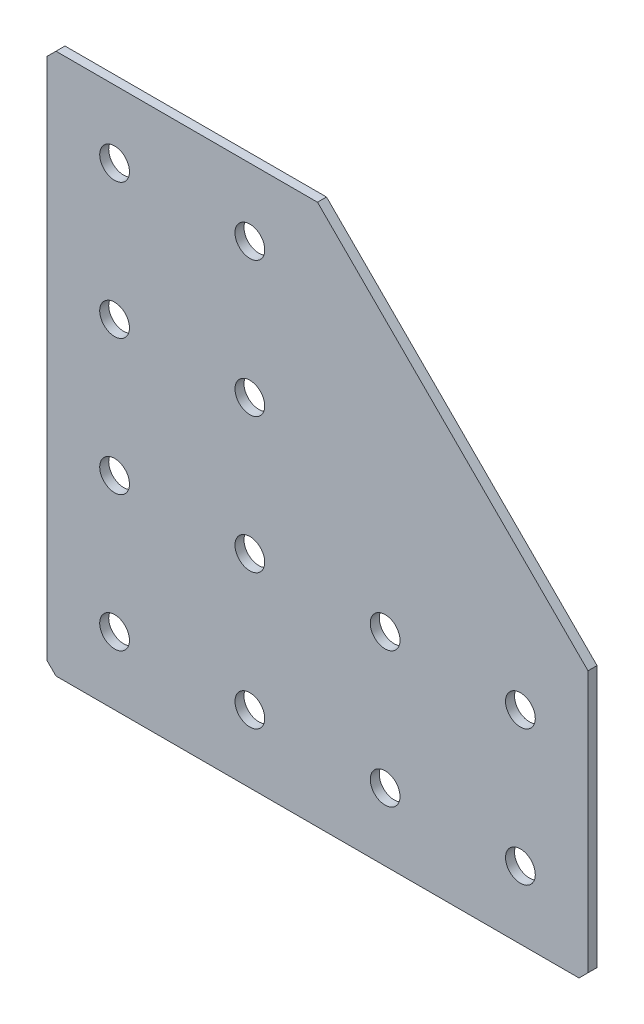
ISO-10303-21;
HEADER;
FILE_DESCRIPTION(('STEP AP214'),'2;1');
FILE_NAME('part.step','',(''),(''),'','','');
FILE_SCHEMA(('AUTOMOTIVE_DESIGN { 1 0 10303 214 1 1 1 1 }'));
ENDSEC;
DATA;
#1=APPLICATION_CONTEXT('core data for automotive mechanical design processes');
#2=APPLICATION_PROTOCOL_DEFINITION('international standard','automotive_design',2000,#1);
#3=PRODUCT_CONTEXT('',#1,'mechanical');
#4=PRODUCT('Part','Part','',(#3));
#5=PRODUCT_RELATED_PRODUCT_CATEGORY('part','',(#4));
#6=PRODUCT_DEFINITION_FORMATION('','',#4);
#7=PRODUCT_DEFINITION_CONTEXT('part definition',#1,'design');
#8=PRODUCT_DEFINITION('design','',#6,#7);
#9=PRODUCT_DEFINITION_SHAPE('','',#8);
#10=(LENGTH_UNIT() NAMED_UNIT(*) SI_UNIT(.MILLI.,.METRE.));
#11=(NAMED_UNIT(*) PLANE_ANGLE_UNIT() SI_UNIT($,.RADIAN.));
#12=(NAMED_UNIT(*) SI_UNIT($,.STERADIAN.) SOLID_ANGLE_UNIT());
#13=UNCERTAINTY_MEASURE_WITH_UNIT(LENGTH_MEASURE(1.E-05),#10,'distance_accuracy_value','');
#14=(GEOMETRIC_REPRESENTATION_CONTEXT(3) GLOBAL_UNCERTAINTY_ASSIGNED_CONTEXT((#13)) GLOBAL_UNIT_ASSIGNED_CONTEXT((#10,
#11,#12)) REPRESENTATION_CONTEXT('',''));
#15=CARTESIAN_POINT('',(0.,0.,0.));
#16=DIRECTION('',(0.,0.,1.));
#17=DIRECTION('',(1.,0.,0.));
#18=AXIS2_PLACEMENT_3D('',#15,#16,#17);
#19=CARTESIAN_POINT('',(0.,0.,0.));
#20=DIRECTION('',(0.,0.,1.));
#21=DIRECTION('',(1.,0.,0.));
#22=AXIS2_PLACEMENT_3D('',#19,#20,#21);
#23=PLANE('',#22);
#24=CARTESIAN_POINT('',(15.,-105.,0.));
#25=DIRECTION('',(0.,0.,-1.));
#26=DIRECTION('',(0.,1.,0.));
#27=AXIS2_PLACEMENT_3D('',#24,#25,#26);
#28=CIRCLE('',#27,3.3);
#29=CARTESIAN_POINT('',(15.,-101.7,0.));
#30=VERTEX_POINT('',#29);
#31=EDGE_CURVE('E239',#30,#30,#28,.T.);
#32=ORIENTED_EDGE('',*,*,#31,.T.);
#33=EDGE_LOOP('',(#32));
#34=FACE_BOUND('',#33,.T.);
#35=CARTESIAN_POINT('',(15.,-75.,0.));
#36=DIRECTION('',(0.,0.,-1.));
#37=DIRECTION('',(0.,1.,0.));
#38=AXIS2_PLACEMENT_3D('',#35,#36,#37);
#39=CIRCLE('',#38,3.3);
#40=CARTESIAN_POINT('',(15.,-71.7,0.));
#41=VERTEX_POINT('',#40);
#42=EDGE_CURVE('E233',#41,#41,#39,.T.);
#43=ORIENTED_EDGE('',*,*,#42,.T.);
#44=EDGE_LOOP('',(#43));
#45=FACE_BOUND('',#44,.T.);
#46=CARTESIAN_POINT('',(15.,-45.,0.));
#47=DIRECTION('',(0.,0.,-1.));
#48=DIRECTION('',(0.,1.,0.));
#49=AXIS2_PLACEMENT_3D('',#46,#47,#48);
#50=CIRCLE('',#49,3.3);
#51=CARTESIAN_POINT('',(15.,-41.7,0.));
#52=VERTEX_POINT('',#51);
#53=EDGE_CURVE('E227',#52,#52,#50,.T.);
#54=ORIENTED_EDGE('',*,*,#53,.T.);
#55=EDGE_LOOP('',(#54));
#56=FACE_BOUND('',#55,.T.);
#57=CARTESIAN_POINT('',(15.,-15.,0.));
#58=DIRECTION('',(0.,0.,-1.));
#59=DIRECTION('',(0.,1.,0.));
#60=AXIS2_PLACEMENT_3D('',#57,#58,#59);
#61=CIRCLE('',#60,3.3);
#62=CARTESIAN_POINT('',(15.,-11.7,0.));
#63=VERTEX_POINT('',#62);
#64=EDGE_CURVE('E221',#63,#63,#61,.T.);
#65=ORIENTED_EDGE('',*,*,#64,.T.);
#66=EDGE_LOOP('',(#65));
#67=FACE_BOUND('',#66,.T.);
#68=CARTESIAN_POINT('',(45.,-105.,0.));
#69=DIRECTION('',(0.,0.,-1.));
#70=DIRECTION('',(0.,1.,0.));
#71=AXIS2_PLACEMENT_3D('',#68,#69,#70);
#72=CIRCLE('',#71,3.3);
#73=CARTESIAN_POINT('',(45.,-101.7,0.));
#74=VERTEX_POINT('',#73);
#75=EDGE_CURVE('E215',#74,#74,#72,.T.);
#76=ORIENTED_EDGE('',*,*,#75,.T.);
#77=EDGE_LOOP('',(#76));
#78=FACE_BOUND('',#77,.T.);
#79=CARTESIAN_POINT('',(45.,-75.,0.));
#80=DIRECTION('',(0.,0.,-1.));
#81=DIRECTION('',(0.,1.,0.));
#82=AXIS2_PLACEMENT_3D('',#79,#80,#81);
#83=CIRCLE('',#82,3.3);
#84=CARTESIAN_POINT('',(45.,-71.7,0.));
#85=VERTEX_POINT('',#84);
#86=EDGE_CURVE('E209',#85,#85,#83,.T.);
#87=ORIENTED_EDGE('',*,*,#86,.T.);
#88=EDGE_LOOP('',(#87));
#89=FACE_BOUND('',#88,.T.);
#90=CARTESIAN_POINT('',(45.,-45.,0.));
#91=DIRECTION('',(0.,0.,-1.));
#92=DIRECTION('',(0.,1.,0.));
#93=AXIS2_PLACEMENT_3D('',#90,#91,#92);
#94=CIRCLE('',#93,3.3);
#95=CARTESIAN_POINT('',(45.,-41.7,0.));
#96=VERTEX_POINT('',#95);
#97=EDGE_CURVE('E203',#96,#96,#94,.T.);
#98=ORIENTED_EDGE('',*,*,#97,.T.);
#99=EDGE_LOOP('',(#98));
#100=FACE_BOUND('',#99,.T.);
#101=CARTESIAN_POINT('',(45.,-15.,0.));
#102=DIRECTION('',(0.,0.,-1.));
#103=DIRECTION('',(0.,1.,0.));
#104=AXIS2_PLACEMENT_3D('',#101,#102,#103);
#105=CIRCLE('',#104,3.3);
#106=CARTESIAN_POINT('',(45.,-11.7,0.));
#107=VERTEX_POINT('',#106);
#108=EDGE_CURVE('E197',#107,#107,#105,.T.);
#109=ORIENTED_EDGE('',*,*,#108,.T.);
#110=EDGE_LOOP('',(#109));
#111=FACE_BOUND('',#110,.T.);
#112=CARTESIAN_POINT('',(75.,-105.,0.));
#113=DIRECTION('',(0.,0.,-1.));
#114=DIRECTION('',(0.,1.,0.));
#115=AXIS2_PLACEMENT_3D('',#112,#113,#114);
#116=CIRCLE('',#115,3.3);
#117=CARTESIAN_POINT('',(75.,-101.7,0.));
#118=VERTEX_POINT('',#117);
#119=EDGE_CURVE('E191',#118,#118,#116,.T.);
#120=ORIENTED_EDGE('',*,*,#119,.T.);
#121=EDGE_LOOP('',(#120));
#122=FACE_BOUND('',#121,.T.);
#123=CARTESIAN_POINT('',(75.,-75.,0.));
#124=DIRECTION('',(0.,0.,-1.));
#125=DIRECTION('',(0.,1.,0.));
#126=AXIS2_PLACEMENT_3D('',#123,#124,#125);
#127=CIRCLE('',#126,3.3);
#128=CARTESIAN_POINT('',(75.,-71.7,0.));
#129=VERTEX_POINT('',#128);
#130=EDGE_CURVE('E185',#129,#129,#127,.T.);
#131=ORIENTED_EDGE('',*,*,#130,.T.);
#132=EDGE_LOOP('',(#131));
#133=FACE_BOUND('',#132,.T.);
#134=DIRECTION('',(1.,0.,0.));
#135=VECTOR('',#134,1.);
#136=CARTESIAN_POINT('',(60.,0.,0.));
#137=LINE('',#136,#135);
#138=CARTESIAN_POINT('',(2.00000000000003,0.,0.));
#139=VERTEX_POINT('',#138);
#140=CARTESIAN_POINT('',(60.,0.,0.));
#141=VERTEX_POINT('',#140);
#142=EDGE_CURVE('E126',#139,#141,#137,.T.);
#143=ORIENTED_EDGE('',*,*,#142,.F.);
#144=DIRECTION('',(0.707106781186547,0.707106781186548,0.));
#145=VECTOR('',#144,1.);
#146=CARTESIAN_POINT('',(1.00000000000001,-1.00000000000001,0.));
#147=LINE('',#146,#145);
#148=CARTESIAN_POINT('',(0.,-2.00000000000003,0.));
#149=VERTEX_POINT('',#148);
#150=EDGE_CURVE('E139',#139,#149,#147,.F.);
#151=ORIENTED_EDGE('',*,*,#150,.T.);
#152=DIRECTION('',(0.,1.,0.));
#153=VECTOR('',#152,1.);
#154=CARTESIAN_POINT('',(0.,0.,0.));
#155=LINE('',#154,#153);
#156=CARTESIAN_POINT('',(0.,-118.,0.));
#157=VERTEX_POINT('',#156);
#158=EDGE_CURVE('E113',#157,#149,#155,.T.);
#159=ORIENTED_EDGE('',*,*,#158,.F.);
#160=DIRECTION('',(-0.707106781186552,0.707106781186543,0.));
#161=VECTOR('',#160,1.);
#162=CARTESIAN_POINT('',(-59.,-59.0000000000008,0.));
#163=LINE('',#162,#161);
#164=CARTESIAN_POINT('',(2.00000000000003,-120.,0.));
#165=VERTEX_POINT('',#164);
#166=EDGE_CURVE('E130',#157,#165,#163,.F.);
#167=ORIENTED_EDGE('',*,*,#166,.T.);
#168=DIRECTION('',(-1.,0.,0.));
#169=VECTOR('',#168,1.);
#170=CARTESIAN_POINT('',(0.,-120.,0.));
#171=LINE('',#170,#169);
#172=CARTESIAN_POINT('',(118.,-120.,0.));
#173=VERTEX_POINT('',#172);
#174=EDGE_CURVE('E154',#173,#165,#171,.T.);
#175=ORIENTED_EDGE('',*,*,#174,.F.);
#176=DIRECTION('',(-0.707106781186543,-0.707106781186552,0.));
#177=VECTOR('',#176,1.);
#178=CARTESIAN_POINT('',(119.000000000001,-118.999999999999,0.));
#179=LINE('',#178,#177);
#180=CARTESIAN_POINT('',(120.,-118.,0.));
#181=VERTEX_POINT('',#180);
#182=EDGE_CURVE('E137',#173,#181,#179,.F.);
#183=ORIENTED_EDGE('',*,*,#182,.T.);
#184=DIRECTION('',(0.,-1.,0.));
#185=VECTOR('',#184,1.);
#186=CARTESIAN_POINT('',(120.,-120.,0.));
#187=LINE('',#186,#185);
#188=CARTESIAN_POINT('',(120.,-60.,0.));
#189=VERTEX_POINT('',#188);
#190=EDGE_CURVE('E162',#189,#181,#187,.T.);
#191=ORIENTED_EDGE('',*,*,#190,.F.);
#192=DIRECTION('',(0.707106781186547,-0.707106781186547,0.));
#193=VECTOR('',#192,1.);
#194=CARTESIAN_POINT('',(120.,-60.,0.));
#195=LINE('',#194,#193);
#196=EDGE_CURVE('E165',#141,#189,#195,.T.);
#197=ORIENTED_EDGE('',*,*,#196,.F.);
#198=EDGE_LOOP('',(#143,#151,#159,#167,#175,#183,#191,#197));
#199=FACE_BOUND('',#198,.T.);
#200=CARTESIAN_POINT('',(105.,-75.,0.));
#201=DIRECTION('',(0.,0.,-1.));
#202=DIRECTION('',(0.,1.,0.));
#203=AXIS2_PLACEMENT_3D('',#200,#201,#202);
#204=CIRCLE('',#203,3.3);
#205=CARTESIAN_POINT('',(105.,-71.7,0.));
#206=VERTEX_POINT('',#205);
#207=EDGE_CURVE('E170',#206,#206,#204,.T.);
#208=ORIENTED_EDGE('',*,*,#207,.T.);
#209=EDGE_LOOP('',(#208));
#210=FACE_BOUND('',#209,.T.);
#211=CARTESIAN_POINT('',(105.,-105.,0.));
#212=DIRECTION('',(0.,0.,-1.));
#213=DIRECTION('',(0.,1.,0.));
#214=AXIS2_PLACEMENT_3D('',#211,#212,#213);
#215=CIRCLE('',#214,3.3);
#216=CARTESIAN_POINT('',(105.,-101.7,0.));
#217=VERTEX_POINT('',#216);
#218=EDGE_CURVE('E179',#217,#217,#215,.T.);
#219=ORIENTED_EDGE('',*,*,#218,.T.);
#220=EDGE_LOOP('',(#219));
#221=FACE_BOUND('',#220,.T.);
#222=ADVANCED_FACE('F37',(#34,#45,#56,#67,#78,#89,#100,#111,#122,#133,#199,#210,#221),#23,.T.);
#223=CARTESIAN_POINT('',(60.,0.,-2.));
#224=DIRECTION('',(0.,-1.,0.));
#225=DIRECTION('',(1.,0.,0.));
#226=AXIS2_PLACEMENT_3D('',#223,#224,#225);
#227=PLANE('',#226);
#228=DIRECTION('',(1.,0.,0.));
#229=VECTOR('',#228,1.);
#230=CARTESIAN_POINT('',(60.,0.,-2.));
#231=LINE('',#230,#229);
#232=CARTESIAN_POINT('',(2.00000000000003,0.,-2.));
#233=VERTEX_POINT('',#232);
#234=CARTESIAN_POINT('',(60.,0.,-2.));
#235=VERTEX_POINT('',#234);
#236=EDGE_CURVE('E101',#233,#235,#231,.T.);
#237=ORIENTED_EDGE('',*,*,#236,.F.);
#238=DIRECTION('',(0.,0.,1.));
#239=VECTOR('',#238,1.);
#240=CARTESIAN_POINT('',(2.00000000000003,0.,-2.));
#241=LINE('',#240,#239);
#242=EDGE_CURVE('E128',#233,#139,#241,.T.);
#243=ORIENTED_EDGE('',*,*,#242,.T.);
#244=ORIENTED_EDGE('',*,*,#142,.T.);
#245=DIRECTION('',(0.,0.,1.));
#246=VECTOR('',#245,1.);
#247=CARTESIAN_POINT('',(60.,0.,-2.));
#248=LINE('',#247,#246);
#249=EDGE_CURVE('E118',#235,#141,#248,.T.);
#250=ORIENTED_EDGE('',*,*,#249,.F.);
#251=EDGE_LOOP('',(#237,#243,#244,#250));
#252=FACE_BOUND('',#251,.T.);
#253=ADVANCED_FACE('F124',(#252),#227,.F.);
#254=CARTESIAN_POINT('',(120.,-60.,-2.));
#255=DIRECTION('',(-0.707106781186547,-0.707106781186547,0.));
#256=DIRECTION('',(0.707106781186548,-0.707106781186548,0.));
#257=AXIS2_PLACEMENT_3D('',#254,#255,#256);
#258=PLANE('',#257);
#259=ORIENTED_EDGE('',*,*,#196,.T.);
#260=DIRECTION('',(0.,0.,1.));
#261=VECTOR('',#260,1.);
#262=CARTESIAN_POINT('',(120.,-60.,-2.));
#263=LINE('',#262,#261);
#264=CARTESIAN_POINT('',(120.,-60.,-2.));
#265=VERTEX_POINT('',#264);
#266=EDGE_CURVE('E120',#265,#189,#263,.T.);
#267=ORIENTED_EDGE('',*,*,#266,.F.);
#268=DIRECTION('',(0.707106781186547,-0.707106781186547,0.));
#269=VECTOR('',#268,1.);
#270=CARTESIAN_POINT('',(120.,-60.,-2.));
#271=LINE('',#270,#269);
#272=EDGE_CURVE('E105',#235,#265,#271,.T.);
#273=ORIENTED_EDGE('',*,*,#272,.F.);
#274=ORIENTED_EDGE('',*,*,#249,.T.);
#275=EDGE_LOOP('',(#259,#267,#273,#274));
#276=FACE_BOUND('',#275,.T.);
#277=ADVANCED_FACE('F117',(#276),#258,.F.);
#278=CARTESIAN_POINT('',(120.,-120.,-2.));
#279=DIRECTION('',(-1.,0.,0.));
#280=DIRECTION('',(0.,0.,1.));
#281=AXIS2_PLACEMENT_3D('',#278,#279,#280);
#282=PLANE('',#281);
#283=ORIENTED_EDGE('',*,*,#190,.T.);
#284=DIRECTION('',(0.,0.,-1.));
#285=VECTOR('',#284,1.);
#286=CARTESIAN_POINT('',(120.,-118.,-2.));
#287=LINE('',#286,#285);
#288=CARTESIAN_POINT('',(120.,-118.,-2.));
#289=VERTEX_POINT('',#288);
#290=EDGE_CURVE('E11',#181,#289,#287,.T.);
#291=ORIENTED_EDGE('',*,*,#290,.T.);
#292=DIRECTION('',(0.,-1.,0.));
#293=VECTOR('',#292,1.);
#294=CARTESIAN_POINT('',(120.,-120.,-2.));
#295=LINE('',#294,#293);
#296=EDGE_CURVE('E122',#265,#289,#295,.T.);
#297=ORIENTED_EDGE('',*,*,#296,.F.);
#298=ORIENTED_EDGE('',*,*,#266,.T.);
#299=EDGE_LOOP('',(#283,#291,#297,#298));
#300=FACE_BOUND('',#299,.T.);
#301=ADVANCED_FACE('F300',(#300),#282,.F.);
#302=CARTESIAN_POINT('',(0.,-120.,-2.));
#303=DIRECTION('',(0.,1.,0.));
#304=DIRECTION('',(0.,0.,1.));
#305=AXIS2_PLACEMENT_3D('',#302,#303,#304);
#306=PLANE('',#305);
#307=DIRECTION('',(-1.,0.,0.));
#308=VECTOR('',#307,1.);
#309=CARTESIAN_POINT('',(0.,-120.,-2.));
#310=LINE('',#309,#308);
#311=CARTESIAN_POINT('',(118.,-120.,-2.));
#312=VERTEX_POINT('',#311);
#313=CARTESIAN_POINT('',(2.00000000000003,-120.,-2.));
#314=VERTEX_POINT('',#313);
#315=EDGE_CURVE('E155',#312,#314,#310,.T.);
#316=ORIENTED_EDGE('',*,*,#315,.F.);
#317=DIRECTION('',(0.,0.,1.));
#318=VECTOR('',#317,1.);
#319=CARTESIAN_POINT('',(118.,-120.,-2.));
#320=LINE('',#319,#318);
#321=EDGE_CURVE('E45',#312,#173,#320,.T.);
#322=ORIENTED_EDGE('',*,*,#321,.T.);
#323=ORIENTED_EDGE('',*,*,#174,.T.);
#324=DIRECTION('',(0.,0.,-1.));
#325=VECTOR('',#324,1.);
#326=CARTESIAN_POINT('',(2.00000000000003,-120.,-2.));
#327=LINE('',#326,#325);
#328=EDGE_CURVE('E52',#165,#314,#327,.T.);
#329=ORIENTED_EDGE('',*,*,#328,.T.);
#330=EDGE_LOOP('',(#316,#322,#323,#329));
#331=FACE_BOUND('',#330,.T.);
#332=ADVANCED_FACE('F153',(#331),#306,.F.);
#333=CARTESIAN_POINT('',(0.,0.,-2.));
#334=DIRECTION('',(1.,0.,0.));
#335=DIRECTION('',(0.,0.,-1.));
#336=AXIS2_PLACEMENT_3D('',#333,#334,#335);
#337=PLANE('',#336);
#338=ORIENTED_EDGE('',*,*,#158,.T.);
#339=DIRECTION('',(0.,0.,-1.));
#340=VECTOR('',#339,1.);
#341=CARTESIAN_POINT('',(0.,-2.00000000000003,-2.));
#342=LINE('',#341,#340);
#343=CARTESIAN_POINT('',(0.,-2.00000000000003,-2.));
#344=VERTEX_POINT('',#343);
#345=EDGE_CURVE('E144',#149,#344,#342,.T.);
#346=ORIENTED_EDGE('',*,*,#345,.T.);
#347=DIRECTION('',(0.,1.,0.));
#348=VECTOR('',#347,1.);
#349=CARTESIAN_POINT('',(0.,0.,-2.));
#350=LINE('',#349,#348);
#351=CARTESIAN_POINT('',(0.,-118.,-2.));
#352=VERTEX_POINT('',#351);
#353=EDGE_CURVE('E132',#352,#344,#350,.T.);
#354=ORIENTED_EDGE('',*,*,#353,.F.);
#355=DIRECTION('',(0.,0.,1.));
#356=VECTOR('',#355,1.);
#357=CARTESIAN_POINT('',(0.,-118.,-2.));
#358=LINE('',#357,#356);
#359=EDGE_CURVE('E141',#352,#157,#358,.T.);
#360=ORIENTED_EDGE('',*,*,#359,.T.);
#361=EDGE_LOOP('',(#338,#346,#354,#360));
#362=FACE_BOUND('',#361,.T.);
#363=ADVANCED_FACE('F251',(#362),#337,.F.);
#364=CARTESIAN_POINT('',(0.,0.,-2.));
#365=DIRECTION('',(0.,0.,1.));
#366=DIRECTION('',(1.,0.,0.));
#367=AXIS2_PLACEMENT_3D('',#364,#365,#366);
#368=PLANE('',#367);
#369=CARTESIAN_POINT('',(15.,-105.,-2.00000000000001));
#370=DIRECTION('',(0.,0.,-1.));
#371=DIRECTION('',(0.,1.,0.));
#372=AXIS2_PLACEMENT_3D('',#369,#370,#371);
#373=CIRCLE('',#372,3.3);
#374=CARTESIAN_POINT('',(15.,-101.7,-2.00000000000001));
#375=VERTEX_POINT('',#374);
#376=EDGE_CURVE('E242',#375,#375,#373,.T.);
#377=ORIENTED_EDGE('',*,*,#376,.F.);
#378=EDGE_LOOP('',(#377));
#379=FACE_BOUND('',#378,.T.);
#380=CARTESIAN_POINT('',(15.,-75.,-2.));
#381=DIRECTION('',(0.,0.,-1.));
#382=DIRECTION('',(0.,1.,0.));
#383=AXIS2_PLACEMENT_3D('',#380,#381,#382);
#384=CIRCLE('',#383,3.3);
#385=CARTESIAN_POINT('',(15.,-71.7,-2.));
#386=VERTEX_POINT('',#385);
#387=EDGE_CURVE('E236',#386,#386,#384,.T.);
#388=ORIENTED_EDGE('',*,*,#387,.F.);
#389=EDGE_LOOP('',(#388));
#390=FACE_BOUND('',#389,.T.);
#391=CARTESIAN_POINT('',(15.,-45.,-2.));
#392=DIRECTION('',(0.,0.,-1.));
#393=DIRECTION('',(0.,1.,0.));
#394=AXIS2_PLACEMENT_3D('',#391,#392,#393);
#395=CIRCLE('',#394,3.3);
#396=CARTESIAN_POINT('',(15.,-41.7,-2.));
#397=VERTEX_POINT('',#396);
#398=EDGE_CURVE('E230',#397,#397,#395,.T.);
#399=ORIENTED_EDGE('',*,*,#398,.F.);
#400=EDGE_LOOP('',(#399));
#401=FACE_BOUND('',#400,.T.);
#402=CARTESIAN_POINT('',(15.,-15.,-2.));
#403=DIRECTION('',(0.,0.,-1.));
#404=DIRECTION('',(0.,1.,0.));
#405=AXIS2_PLACEMENT_3D('',#402,#403,#404);
#406=CIRCLE('',#405,3.3);
#407=CARTESIAN_POINT('',(15.,-11.7,-2.));
#408=VERTEX_POINT('',#407);
#409=EDGE_CURVE('E224',#408,#408,#406,.T.);
#410=ORIENTED_EDGE('',*,*,#409,.F.);
#411=EDGE_LOOP('',(#410));
#412=FACE_BOUND('',#411,.T.);
#413=CARTESIAN_POINT('',(45.,-105.,-2.00000000000001));
#414=DIRECTION('',(0.,0.,-1.));
#415=DIRECTION('',(0.,1.,0.));
#416=AXIS2_PLACEMENT_3D('',#413,#414,#415);
#417=CIRCLE('',#416,3.3);
#418=CARTESIAN_POINT('',(45.,-101.7,-2.00000000000001));
#419=VERTEX_POINT('',#418);
#420=EDGE_CURVE('E218',#419,#419,#417,.T.);
#421=ORIENTED_EDGE('',*,*,#420,.F.);
#422=EDGE_LOOP('',(#421));
#423=FACE_BOUND('',#422,.T.);
#424=CARTESIAN_POINT('',(45.,-75.,-2.));
#425=DIRECTION('',(0.,0.,-1.));
#426=DIRECTION('',(0.,1.,0.));
#427=AXIS2_PLACEMENT_3D('',#424,#425,#426);
#428=CIRCLE('',#427,3.3);
#429=CARTESIAN_POINT('',(45.,-71.7,-2.));
#430=VERTEX_POINT('',#429);
#431=EDGE_CURVE('E212',#430,#430,#428,.T.);
#432=ORIENTED_EDGE('',*,*,#431,.F.);
#433=EDGE_LOOP('',(#432));
#434=FACE_BOUND('',#433,.T.);
#435=CARTESIAN_POINT('',(45.,-45.,-2.));
#436=DIRECTION('',(0.,0.,-1.));
#437=DIRECTION('',(0.,1.,0.));
#438=AXIS2_PLACEMENT_3D('',#435,#436,#437);
#439=CIRCLE('',#438,3.3);
#440=CARTESIAN_POINT('',(45.,-41.7,-2.));
#441=VERTEX_POINT('',#440);
#442=EDGE_CURVE('E206',#441,#441,#439,.T.);
#443=ORIENTED_EDGE('',*,*,#442,.F.);
#444=EDGE_LOOP('',(#443));
#445=FACE_BOUND('',#444,.T.);
#446=CARTESIAN_POINT('',(45.,-15.,-2.));
#447=DIRECTION('',(0.,0.,-1.));
#448=DIRECTION('',(0.,1.,0.));
#449=AXIS2_PLACEMENT_3D('',#446,#447,#448);
#450=CIRCLE('',#449,3.3);
#451=CARTESIAN_POINT('',(45.,-11.7,-2.));
#452=VERTEX_POINT('',#451);
#453=EDGE_CURVE('E200',#452,#452,#450,.T.);
#454=ORIENTED_EDGE('',*,*,#453,.F.);
#455=EDGE_LOOP('',(#454));
#456=FACE_BOUND('',#455,.T.);
#457=CARTESIAN_POINT('',(75.,-105.,-2.00000000000001));
#458=DIRECTION('',(0.,0.,-1.));
#459=DIRECTION('',(0.,1.,0.));
#460=AXIS2_PLACEMENT_3D('',#457,#458,#459);
#461=CIRCLE('',#460,3.3);
#462=CARTESIAN_POINT('',(75.,-101.7,-2.00000000000001));
#463=VERTEX_POINT('',#462);
#464=EDGE_CURVE('E194',#463,#463,#461,.T.);
#465=ORIENTED_EDGE('',*,*,#464,.F.);
#466=EDGE_LOOP('',(#465));
#467=FACE_BOUND('',#466,.T.);
#468=CARTESIAN_POINT('',(75.,-75.,-2.));
#469=DIRECTION('',(0.,0.,-1.));
#470=DIRECTION('',(0.,1.,0.));
#471=AXIS2_PLACEMENT_3D('',#468,#469,#470);
#472=CIRCLE('',#471,3.3);
#473=CARTESIAN_POINT('',(75.,-71.7,-2.));
#474=VERTEX_POINT('',#473);
#475=EDGE_CURVE('E188',#474,#474,#472,.T.);
#476=ORIENTED_EDGE('',*,*,#475,.F.);
#477=EDGE_LOOP('',(#476));
#478=FACE_BOUND('',#477,.T.);
#479=CARTESIAN_POINT('',(105.,-105.,-2.00000000000001));
#480=DIRECTION('',(0.,0.,-1.));
#481=DIRECTION('',(0.,1.,0.));
#482=AXIS2_PLACEMENT_3D('',#479,#480,#481);
#483=CIRCLE('',#482,3.3);
#484=CARTESIAN_POINT('',(105.,-101.7,-2.00000000000001));
#485=VERTEX_POINT('',#484);
#486=EDGE_CURVE('E182',#485,#485,#483,.T.);
#487=ORIENTED_EDGE('',*,*,#486,.F.);
#488=EDGE_LOOP('',(#487));
#489=FACE_BOUND('',#488,.T.);
#490=CARTESIAN_POINT('',(105.,-75.,-2.));
#491=DIRECTION('',(0.,0.,-1.));
#492=DIRECTION('',(0.,1.,0.));
#493=AXIS2_PLACEMENT_3D('',#490,#491,#492);
#494=CIRCLE('',#493,3.3);
#495=CARTESIAN_POINT('',(105.,-71.7,-2.));
#496=VERTEX_POINT('',#495);
#497=EDGE_CURVE('E176',#496,#496,#494,.T.);
#498=ORIENTED_EDGE('',*,*,#497,.F.);
#499=EDGE_LOOP('',(#498));
#500=FACE_BOUND('',#499,.T.);
#501=ORIENTED_EDGE('',*,*,#353,.T.);
#502=DIRECTION('',(-0.707106781186547,-0.707106781186548,0.));
#503=VECTOR('',#502,1.);
#504=CARTESIAN_POINT('',(2.00000000000003,0.,-2.));
#505=LINE('',#504,#503);
#506=EDGE_CURVE('E108',#344,#233,#505,.F.);
#507=ORIENTED_EDGE('',*,*,#506,.T.);
#508=ORIENTED_EDGE('',*,*,#236,.T.);
#509=ORIENTED_EDGE('',*,*,#272,.T.);
#510=ORIENTED_EDGE('',*,*,#296,.T.);
#511=DIRECTION('',(0.707106781186543,0.707106781186552,0.));
#512=VECTOR('',#511,1.);
#513=CARTESIAN_POINT('',(118.,-120.,-2.));
#514=LINE('',#513,#512);
#515=EDGE_CURVE('E59',#289,#312,#514,.F.);
#516=ORIENTED_EDGE('',*,*,#515,.T.);
#517=ORIENTED_EDGE('',*,*,#315,.T.);
#518=DIRECTION('',(0.707106781186552,-0.707106781186543,0.));
#519=VECTOR('',#518,1.);
#520=CARTESIAN_POINT('',(0.,-118.,-2.));
#521=LINE('',#520,#519);
#522=EDGE_CURVE('E146',#314,#352,#521,.F.);
#523=ORIENTED_EDGE('',*,*,#522,.T.);
#524=EDGE_LOOP('',(#501,#507,#508,#509,#510,#516,#517,#523));
#525=FACE_BOUND('',#524,.T.);
#526=ADVANCED_FACE('F104',(#379,#390,#401,#412,#423,#434,#445,#456,#467,#478,#489,#500,#525),
#368,.F.);
#527=CARTESIAN_POINT('',(105.,-75.,-2.));
#528=DIRECTION('',(0.,0.,-1.));
#529=DIRECTION('',(0.,1.,0.));
#530=AXIS2_PLACEMENT_3D('',#527,#528,#529);
#531=CYLINDRICAL_SURFACE('',#530,3.3);
#532=ORIENTED_EDGE('',*,*,#207,.F.);
#533=EDGE_LOOP('',(#532));
#534=FACE_BOUND('',#533,.T.);
#535=ORIENTED_EDGE('',*,*,#497,.T.);
#536=EDGE_LOOP('',(#535));
#537=FACE_BOUND('',#536,.T.);
#538=ADVANCED_FACE('F250',(#534,#537),#531,.F.);
#539=CARTESIAN_POINT('',(105.,-105.,-2.00000000000001));
#540=DIRECTION('',(0.,0.,-1.));
#541=DIRECTION('',(0.,1.,0.));
#542=AXIS2_PLACEMENT_3D('',#539,#540,#541);
#543=CYLINDRICAL_SURFACE('',#542,3.3);
#544=ORIENTED_EDGE('',*,*,#218,.F.);
#545=EDGE_LOOP('',(#544));
#546=FACE_BOUND('',#545,.T.);
#547=ORIENTED_EDGE('',*,*,#486,.T.);
#548=EDGE_LOOP('',(#547));
#549=FACE_BOUND('',#548,.T.);
#550=ADVANCED_FACE('F276',(#546,#549),#543,.F.);
#551=CARTESIAN_POINT('',(75.,-75.,-2.));
#552=DIRECTION('',(0.,0.,-1.));
#553=DIRECTION('',(0.,1.,0.));
#554=AXIS2_PLACEMENT_3D('',#551,#552,#553);
#555=CYLINDRICAL_SURFACE('',#554,3.3);
#556=ORIENTED_EDGE('',*,*,#130,.F.);
#557=EDGE_LOOP('',(#556));
#558=FACE_BOUND('',#557,.T.);
#559=ORIENTED_EDGE('',*,*,#475,.T.);
#560=EDGE_LOOP('',(#559));
#561=FACE_BOUND('',#560,.T.);
#562=ADVANCED_FACE('F282',(#558,#561),#555,.F.);
#563=CARTESIAN_POINT('',(75.,-105.,-2.00000000000001));
#564=DIRECTION('',(0.,0.,-1.));
#565=DIRECTION('',(0.,1.,0.));
#566=AXIS2_PLACEMENT_3D('',#563,#564,#565);
#567=CYLINDRICAL_SURFACE('',#566,3.3);
#568=ORIENTED_EDGE('',*,*,#119,.F.);
#569=EDGE_LOOP('',(#568));
#570=FACE_BOUND('',#569,.T.);
#571=ORIENTED_EDGE('',*,*,#464,.T.);
#572=EDGE_LOOP('',(#571));
#573=FACE_BOUND('',#572,.T.);
#574=ADVANCED_FACE('F447',(#570,#573),#567,.F.);
#575=CARTESIAN_POINT('',(45.,-15.,-2.));
#576=DIRECTION('',(0.,0.,-1.));
#577=DIRECTION('',(0.,1.,0.));
#578=AXIS2_PLACEMENT_3D('',#575,#576,#577);
#579=CYLINDRICAL_SURFACE('',#578,3.3);
#580=ORIENTED_EDGE('',*,*,#108,.F.);
#581=EDGE_LOOP('',(#580));
#582=FACE_BOUND('',#581,.T.);
#583=ORIENTED_EDGE('',*,*,#453,.T.);
#584=EDGE_LOOP('',(#583));
#585=FACE_BOUND('',#584,.T.);
#586=ADVANCED_FACE('F437',(#582,#585),#579,.F.);
#587=CARTESIAN_POINT('',(45.,-45.,-2.));
#588=DIRECTION('',(0.,0.,-1.));
#589=DIRECTION('',(0.,1.,0.));
#590=AXIS2_PLACEMENT_3D('',#587,#588,#589);
#591=CYLINDRICAL_SURFACE('',#590,3.3);
#592=ORIENTED_EDGE('',*,*,#97,.F.);
#593=EDGE_LOOP('',(#592));
#594=FACE_BOUND('',#593,.T.);
#595=ORIENTED_EDGE('',*,*,#442,.T.);
#596=EDGE_LOOP('',(#595));
#597=FACE_BOUND('',#596,.T.);
#598=ADVANCED_FACE('F427',(#594,#597),#591,.F.);
#599=CARTESIAN_POINT('',(45.,-75.,-2.));
#600=DIRECTION('',(0.,0.,-1.));
#601=DIRECTION('',(0.,1.,0.));
#602=AXIS2_PLACEMENT_3D('',#599,#600,#601);
#603=CYLINDRICAL_SURFACE('',#602,3.3);
#604=ORIENTED_EDGE('',*,*,#86,.F.);
#605=EDGE_LOOP('',(#604));
#606=FACE_BOUND('',#605,.T.);
#607=ORIENTED_EDGE('',*,*,#431,.T.);
#608=EDGE_LOOP('',(#607));
#609=FACE_BOUND('',#608,.T.);
#610=ADVANCED_FACE('F417',(#606,#609),#603,.F.);
#611=CARTESIAN_POINT('',(45.,-105.,-2.00000000000001));
#612=DIRECTION('',(0.,0.,-1.));
#613=DIRECTION('',(0.,1.,0.));
#614=AXIS2_PLACEMENT_3D('',#611,#612,#613);
#615=CYLINDRICAL_SURFACE('',#614,3.3);
#616=ORIENTED_EDGE('',*,*,#75,.F.);
#617=EDGE_LOOP('',(#616));
#618=FACE_BOUND('',#617,.T.);
#619=ORIENTED_EDGE('',*,*,#420,.T.);
#620=EDGE_LOOP('',(#619));
#621=FACE_BOUND('',#620,.T.);
#622=ADVANCED_FACE('F407',(#618,#621),#615,.F.);
#623=CARTESIAN_POINT('',(15.,-15.,-2.));
#624=DIRECTION('',(0.,0.,-1.));
#625=DIRECTION('',(0.,1.,0.));
#626=AXIS2_PLACEMENT_3D('',#623,#624,#625);
#627=CYLINDRICAL_SURFACE('',#626,3.3);
#628=ORIENTED_EDGE('',*,*,#64,.F.);
#629=EDGE_LOOP('',(#628));
#630=FACE_BOUND('',#629,.T.);
#631=ORIENTED_EDGE('',*,*,#409,.T.);
#632=EDGE_LOOP('',(#631));
#633=FACE_BOUND('',#632,.T.);
#634=ADVANCED_FACE('F397',(#630,#633),#627,.F.);
#635=CARTESIAN_POINT('',(15.,-45.,-2.));
#636=DIRECTION('',(0.,0.,-1.));
#637=DIRECTION('',(0.,1.,0.));
#638=AXIS2_PLACEMENT_3D('',#635,#636,#637);
#639=CYLINDRICAL_SURFACE('',#638,3.3);
#640=ORIENTED_EDGE('',*,*,#53,.F.);
#641=EDGE_LOOP('',(#640));
#642=FACE_BOUND('',#641,.T.);
#643=ORIENTED_EDGE('',*,*,#398,.T.);
#644=EDGE_LOOP('',(#643));
#645=FACE_BOUND('',#644,.T.);
#646=ADVANCED_FACE('F387',(#642,#645),#639,.F.);
#647=CARTESIAN_POINT('',(15.,-75.,-2.));
#648=DIRECTION('',(0.,0.,-1.));
#649=DIRECTION('',(0.,1.,0.));
#650=AXIS2_PLACEMENT_3D('',#647,#648,#649);
#651=CYLINDRICAL_SURFACE('',#650,3.3);
#652=ORIENTED_EDGE('',*,*,#42,.F.);
#653=EDGE_LOOP('',(#652));
#654=FACE_BOUND('',#653,.T.);
#655=ORIENTED_EDGE('',*,*,#387,.T.);
#656=EDGE_LOOP('',(#655));
#657=FACE_BOUND('',#656,.T.);
#658=ADVANCED_FACE('F377',(#654,#657),#651,.F.);
#659=CARTESIAN_POINT('',(15.,-105.,-2.00000000000001));
#660=DIRECTION('',(0.,0.,-1.));
#661=DIRECTION('',(0.,1.,0.));
#662=AXIS2_PLACEMENT_3D('',#659,#660,#661);
#663=CYLINDRICAL_SURFACE('',#662,3.3);
#664=ORIENTED_EDGE('',*,*,#31,.F.);
#665=EDGE_LOOP('',(#664));
#666=FACE_BOUND('',#665,.T.);
#667=ORIENTED_EDGE('',*,*,#376,.T.);
#668=EDGE_LOOP('',(#667));
#669=FACE_BOUND('',#668,.T.);
#670=ADVANCED_FACE('F246',(#666,#669),#663,.F.);
#671=CARTESIAN_POINT('',(2.00000000000003,0.,-2.));
#672=DIRECTION('',(0.707106781186548,-0.707106781186547,0.));
#673=DIRECTION('',(0.,0.,1.));
#674=AXIS2_PLACEMENT_3D('',#671,#672,#673);
#675=PLANE('',#674);
#676=ORIENTED_EDGE('',*,*,#506,.F.);
#677=ORIENTED_EDGE('',*,*,#345,.F.);
#678=ORIENTED_EDGE('',*,*,#150,.F.);
#679=ORIENTED_EDGE('',*,*,#242,.F.);
#680=EDGE_LOOP('',(#676,#677,#678,#679));
#681=FACE_BOUND('',#680,.T.);
#682=ADVANCED_FACE('F306',(#681),#675,.F.);
#683=CARTESIAN_POINT('',(118.,-120.,-2.));
#684=DIRECTION('',(-0.707106781186552,0.707106781186542,0.));
#685=DIRECTION('',(0.,0.,1.));
#686=AXIS2_PLACEMENT_3D('',#683,#684,#685);
#687=PLANE('',#686);
#688=ORIENTED_EDGE('',*,*,#515,.F.);
#689=ORIENTED_EDGE('',*,*,#290,.F.);
#690=ORIENTED_EDGE('',*,*,#182,.F.);
#691=ORIENTED_EDGE('',*,*,#321,.F.);
#692=EDGE_LOOP('',(#688,#689,#690,#691));
#693=FACE_BOUND('',#692,.T.);
#694=ADVANCED_FACE('F308',(#693),#687,.F.);
#695=CARTESIAN_POINT('',(0.,-118.,-2.));
#696=DIRECTION('',(0.707106781186542,0.707106781186552,0.));
#697=DIRECTION('',(0.,0.,1.));
#698=AXIS2_PLACEMENT_3D('',#695,#696,#697);
#699=PLANE('',#698);
#700=ORIENTED_EDGE('',*,*,#522,.F.);
#701=ORIENTED_EDGE('',*,*,#328,.F.);
#702=ORIENTED_EDGE('',*,*,#166,.F.);
#703=ORIENTED_EDGE('',*,*,#359,.F.);
#704=EDGE_LOOP('',(#700,#701,#702,#703));
#705=FACE_BOUND('',#704,.T.);
#706=ADVANCED_FACE('F39',(#705),#699,.F.);
#707=CLOSED_SHELL('',(#222,#253,#277,#301,#332,#363,#526,#538,#550,#562,#574,#586,#598,#610,
#622,#634,#646,#658,#670,#682,#694,#706));
#708=MANIFOLD_SOLID_BREP('B2',#707);
#709=ADVANCED_BREP_SHAPE_REPRESENTATION('',(#18,#708),#14);
#710=SHAPE_DEFINITION_REPRESENTATION(#9,#709);
ENDSEC;
END-ISO-10303-21;
